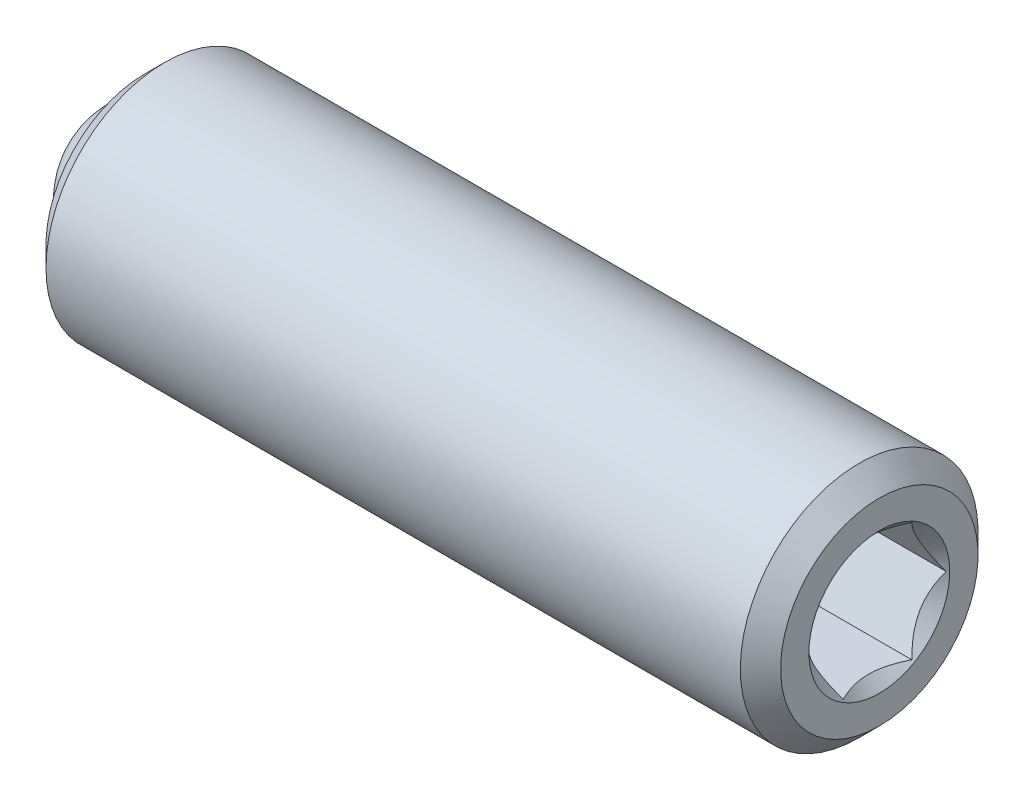
ISO-10303-21;
HEADER;
FILE_DESCRIPTION(('STEP AP214'),'2;1');
FILE_NAME('part.step','',(''),(''),'','','');
FILE_SCHEMA(('AUTOMOTIVE_DESIGN { 1 0 10303 214 1 1 1 1 }'));
ENDSEC;
DATA;
#1=APPLICATION_CONTEXT('core data for automotive mechanical design processes');
#2=APPLICATION_PROTOCOL_DEFINITION('international standard','automotive_design',2000,#1);
#3=PRODUCT_CONTEXT('',#1,'mechanical');
#4=PRODUCT('Part','Part','',(#3));
#5=PRODUCT_RELATED_PRODUCT_CATEGORY('part','',(#4));
#6=PRODUCT_DEFINITION_FORMATION('','',#4);
#7=PRODUCT_DEFINITION_CONTEXT('part definition',#1,'design');
#8=PRODUCT_DEFINITION('design','',#6,#7);
#9=PRODUCT_DEFINITION_SHAPE('','',#8);
#10=(LENGTH_UNIT() NAMED_UNIT(*) SI_UNIT(.MILLI.,.METRE.));
#11=(NAMED_UNIT(*) PLANE_ANGLE_UNIT() SI_UNIT($,.RADIAN.));
#12=(NAMED_UNIT(*) SI_UNIT($,.STERADIAN.) SOLID_ANGLE_UNIT());
#13=UNCERTAINTY_MEASURE_WITH_UNIT(LENGTH_MEASURE(1.E-05),#10,'distance_accuracy_value','');
#14=(GEOMETRIC_REPRESENTATION_CONTEXT(3) GLOBAL_UNCERTAINTY_ASSIGNED_CONTEXT((#13)) GLOBAL_UNIT_ASSIGNED_CONTEXT((#10,
#11,#12)) REPRESENTATION_CONTEXT('',''));
#15=CARTESIAN_POINT('',(0.,0.,0.));
#16=DIRECTION('',(0.,0.,1.));
#17=DIRECTION('',(1.,0.,0.));
#18=AXIS2_PLACEMENT_3D('',#15,#16,#17);
#19=CARTESIAN_POINT('',(-5.26775896178356,1.14341220093835,-0.203857779682182));
#20=DIRECTION('',(1.,0.,0.));
#21=DIRECTION('',(0.,1.,0.));
#22=AXIS2_PLACEMENT_3D('',#19,#20,#21);
#23=PLANE('',#22);
#24=CARTESIAN_POINT('',(-5.26775896178356,0.140112200938348,-0.203857779682182));
#25=DIRECTION('',(1.,0.,0.));
#26=DIRECTION('',(0.,1.,0.));
#27=AXIS2_PLACEMENT_3D('',#24,#25,#26);
#28=CIRCLE('',#27,1.246);
#29=CARTESIAN_POINT('',(-5.26775896178356,1.38611220093835,-0.203857779682182));
#30=VERTEX_POINT('',#29);
#31=EDGE_CURVE('P0_E30',#30,#30,#28,.F.);
#32=ORIENTED_EDGE('',*,*,#31,.T.);
#33=EDGE_LOOP('',(#32));
#34=FACE_BOUND('',#33,.T.);
#35=CARTESIAN_POINT('',(-5.26775896178356,0.140112200938348,-0.203857779682182));
#36=DIRECTION('',(-1.,0.,0.));
#37=DIRECTION('',(0.,-1.,0.));
#38=AXIS2_PLACEMENT_3D('',#35,#36,#37);
#39=CIRCLE('',#38,1.0033);
#40=CARTESIAN_POINT('',(-5.26775896178356,-0.863187799061652,-0.203857779682182));
#41=VERTEX_POINT('',#40);
#42=EDGE_CURVE('P0_E105',#41,#41,#39,.T.);
#43=ORIENTED_EDGE('',*,*,#42,.F.);
#44=EDGE_LOOP('',(#43));
#45=FACE_BOUND('',#44,.T.);
#46=ADVANCED_FACE('P0_F17',(#34,#45),#23,.F.);
#47=CARTESIAN_POINT('',(-3.59137664832728,0.140112200938348,-0.203857779682182));
#48=DIRECTION('',(-1.,0.,0.));
#49=DIRECTION('',(0.,-1.,0.));
#50=AXIS2_PLACEMENT_3D('',#47,#48,#49);
#51=CYLINDRICAL_SURFACE('',#50,1.0033);
#52=CARTESIAN_POINT('',(-4.59467664832728,0.140112200938348,-0.203857779682182));
#53=DIRECTION('',(-1.,0.,0.));
#54=DIRECTION('',(0.,-1.,0.));
#55=AXIS2_PLACEMENT_3D('',#52,#53,#54);
#56=CIRCLE('',#55,1.0033);
#57=CARTESIAN_POINT('',(-4.59467664832728,-0.863187799061652,-0.203857779682182));
#58=VERTEX_POINT('',#57);
#59=EDGE_CURVE('P0_E102',#58,#58,#56,.T.);
#60=ORIENTED_EDGE('',*,*,#59,.F.);
#61=EDGE_LOOP('',(#60));
#62=FACE_BOUND('',#61,.T.);
#63=ORIENTED_EDGE('',*,*,#42,.T.);
#64=EDGE_LOOP('',(#63));
#65=FACE_BOUND('',#64,.T.);
#66=ADVANCED_FACE('P0_F135',(#62,#65),#51,.F.);
#67=CARTESIAN_POINT('',(-4.59467664832728,0.140112200938348,-0.203857779682182));
#68=DIRECTION('',(-1.,0.,0.));
#69=DIRECTION('',(0.,-1.,0.));
#70=AXIS2_PLACEMENT_3D('',#67,#68,#69);
#71=CONICAL_SURFACE('',#70,1.0033,0.78539816339745);
#72=CARTESIAN_POINT('',(-3.59137664832728,0.140112200938348,-0.203857779682182));
#73=VERTEX_POINT('',#72);
#74=VERTEX_LOOP('',#73);
#75=FACE_BOUND('',#74,.T.);
#76=ORIENTED_EDGE('',*,*,#59,.T.);
#77=EDGE_LOOP('',(#76));
#78=FACE_BOUND('',#77,.T.);
#79=ADVANCED_FACE('P0_F140',(#75,#78),#71,.F.);
#80=CARTESIAN_POINT('',(4.00324103821644,0.140112200938348,-0.203857779682182));
#81=DIRECTION('',(-1.,0.,0.));
#82=DIRECTION('',(0.,-1.,0.));
#83=AXIS2_PLACEMENT_3D('',#80,#81,#82);
#84=PLANE('',#83);
#85=CARTESIAN_POINT('',(4.00324103821644,0.140112200938347,-0.203857779682182));
#86=DIRECTION('',(1.,0.,0.));
#87=DIRECTION('',(0.,1.,0.));
#88=AXIS2_PLACEMENT_3D('',#85,#86,#87);
#89=CIRCLE('',#88,0.889);
#90=CARTESIAN_POINT('',(4.00324103821644,1.02911220093835,-0.203857779682182));
#91=VERTEX_POINT('',#90);
#92=EDGE_CURVE('P0_E232',#91,#91,#89,.T.);
#93=ORIENTED_EDGE('',*,*,#92,.F.);
#94=EDGE_LOOP('',(#93));
#95=FACE_BOUND('',#94,.T.);
#96=CARTESIAN_POINT('',(4.00324103821644,0.140112200938348,-0.203857779682182));
#97=DIRECTION('',(-1.,0.,0.));
#98=DIRECTION('',(0.,-1.,0.));
#99=AXIS2_PLACEMENT_3D('',#96,#97,#98);
#100=CIRCLE('',#99,1.246);
#101=CARTESIAN_POINT('',(4.00324103821644,-1.10588779906165,-0.203857779682182));
#102=VERTEX_POINT('',#101);
#103=EDGE_CURVE('P0_E114',#102,#102,#100,.F.);
#104=ORIENTED_EDGE('',*,*,#103,.T.);
#105=EDGE_LOOP('',(#104));
#106=FACE_BOUND('',#105,.T.);
#107=ADVANCED_FACE('P0_F146',(#95,#106),#84,.F.);
#108=CARTESIAN_POINT('',(-3.59137664832728,0.140112200938348,-0.203857779682182));
#109=DIRECTION('',(-1.,0.,0.));
#110=DIRECTION('',(0.,-1.,0.));
#111=AXIS2_PLACEMENT_3D('',#108,#109,#110);
#112=CYLINDRICAL_SURFACE('',#111,1.5);
#113=CARTESIAN_POINT('',(3.74924103821644,0.140112200938348,-0.203857779682182));
#114=DIRECTION('',(-1.,0.,0.));
#115=DIRECTION('',(0.,-1.,0.));
#116=AXIS2_PLACEMENT_3D('',#113,#114,#115);
#117=CIRCLE('',#116,1.5);
#118=CARTESIAN_POINT('',(3.74924103821644,-1.35988779906165,-0.203857779682182));
#119=VERTEX_POINT('',#118);
#120=EDGE_CURVE('P0_E111',#119,#119,#117,.T.);
#121=ORIENTED_EDGE('',*,*,#120,.T.);
#122=EDGE_LOOP('',(#121));
#123=FACE_BOUND('',#122,.T.);
#124=CARTESIAN_POINT('',(-5.01375896178356,0.140112200938348,-0.203857779682182));
#125=DIRECTION('',(1.,0.,0.));
#126=DIRECTION('',(0.,1.,0.));
#127=AXIS2_PLACEMENT_3D('',#124,#125,#126);
#128=CIRCLE('',#127,1.5);
#129=CARTESIAN_POINT('',(-5.01375896178356,1.64011220093835,-0.203857779682182));
#130=VERTEX_POINT('',#129);
#131=EDGE_CURVE('P0_E108',#130,#130,#128,.T.);
#132=ORIENTED_EDGE('',*,*,#131,.T.);
#133=EDGE_LOOP('',(#132));
#134=FACE_BOUND('',#133,.T.);
#135=ADVANCED_FACE('P0_F131',(#123,#134),#112,.T.);
#136=CARTESIAN_POINT('',(3.74924103821644,0.140112200938348,-0.203857779682182));
#137=DIRECTION('',(-1.,0.,0.));
#138=DIRECTION('',(0.,-1.,0.));
#139=AXIS2_PLACEMENT_3D('',#136,#137,#138);
#140=CONICAL_SURFACE('',#139,1.5,0.78539816339745);
#141=ORIENTED_EDGE('',*,*,#103,.F.);
#142=EDGE_LOOP('',(#141));
#143=FACE_BOUND('',#142,.T.);
#144=ORIENTED_EDGE('',*,*,#120,.F.);
#145=EDGE_LOOP('',(#144));
#146=FACE_BOUND('',#145,.T.);
#147=ADVANCED_FACE('P0_F122',(#143,#146),#140,.T.);
#148=CARTESIAN_POINT('',(-5.26775896178356,0.140112200938348,-0.203857779682182));
#149=DIRECTION('',(1.,0.,0.));
#150=DIRECTION('',(0.,1.,0.));
#151=AXIS2_PLACEMENT_3D('',#148,#149,#150);
#152=CONICAL_SURFACE('',#151,1.246,0.785398163397445);
#153=ORIENTED_EDGE('',*,*,#131,.F.);
#154=EDGE_LOOP('',(#153));
#155=FACE_BOUND('',#154,.T.);
#156=ORIENTED_EDGE('',*,*,#31,.F.);
#157=EDGE_LOOP('',(#156));
#158=FACE_BOUND('',#157,.T.);
#159=ADVANCED_FACE('P0_F19',(#155,#158),#152,.T.);
#160=CARTESIAN_POINT('',(4.00324103821644,0.140112200938347,-0.203857779682182));
#161=DIRECTION('',(1.,0.,0.));
#162=DIRECTION('',(0.,1.,0.));
#163=AXIS2_PLACEMENT_3D('',#160,#161,#162);
#164=CONICAL_SURFACE('',#163,0.889,0.78539816339745);
#165=ORIENTED_EDGE('',*,*,#92,.T.);
#166=EDGE_LOOP('',(#165));
#167=FACE_BOUND('',#166,.T.);
#168=CARTESIAN_POINT('',(4.27011407340164,0.890112200938348,-1.08337041374052));
#169=CARTESIAN_POINT('',(4.25387468321521,0.890112200938348,-1.06202509157628));
#170=CARTESIAN_POINT('',(4.23778979157522,0.890112200938348,-1.04056255208413));
#171=CARTESIAN_POINT('',(4.20599327113775,0.890112200938348,-0.997354976569362));
#172=CARTESIAN_POINT('',(4.19028173410769,0.890112200938348,-0.975609873085505));
#173=CARTESIAN_POINT('',(4.1435791702077,0.890112200938348,-0.909560196027857));
#174=CARTESIAN_POINT('',(4.11327002806285,0.890112200938348,-0.864765498836226));
#175=CARTESIAN_POINT('',(4.05362204548442,0.890112200938348,-0.770727906260526));
#176=CARTESIAN_POINT('',(4.02444847758762,0.890112200938348,-0.721378973428742));
#177=CARTESIAN_POINT('',(3.97098003069421,0.890112200938348,-0.620199376924882));
#178=CARTESIAN_POINT('',(3.94666868692797,0.890112200938348,-0.568377850854046));
#179=CARTESIAN_POINT('',(3.91692427189314,0.890112200938348,-0.490735867713308));
#180=CARTESIAN_POINT('',(3.90841515008199,0.890112200938348,-0.466103184642786));
#181=CARTESIAN_POINT('',(3.89336731195443,0.890112200938348,-0.416242867264108));
#182=CARTESIAN_POINT('',(3.88682872705705,0.890112200938348,-0.391015193395758));
#183=CARTESIAN_POINT('',(3.87094826365662,0.890112200938348,-0.315512298621015));
#184=CARTESIAN_POINT('',(3.86494656519245,0.890112200938348,-0.264454169848514));
#185=CARTESIAN_POINT('',(3.86368028255774,0.890112200938348,-0.164196712133303));
#186=CARTESIAN_POINT('',(3.86800545625288,0.890112200938348,-0.115002678500581));
#187=CARTESIAN_POINT('',(3.88110376344025,0.890112200938348,-0.0420620616330124));
#188=CARTESIAN_POINT('',(3.88665433171372,0.890112200938348,-0.0176697553897661));
#189=CARTESIAN_POINT('',(3.89969014752514,0.890112200938348,0.0305909359954269));
#190=CARTESIAN_POINT('',(3.90717525349171,0.890112200938348,0.0544593593370276));
#191=CARTESIAN_POINT('',(3.93335528323793,0.890112200938348,0.128893354159198));
#192=CARTESIAN_POINT('',(3.95500389672139,0.890112200938348,0.178414114462773));
#193=CARTESIAN_POINT('',(4.00315487646798,0.890112200938348,0.275137718993897));
#194=CARTESIAN_POINT('',(4.02967453883853,0.890112200938348,0.322331518174599));
#195=CARTESIAN_POINT('',(4.08440802883982,0.890112200938348,0.412534674067127));
#196=CARTESIAN_POINT('',(4.11247299614644,0.890112200938348,0.455635521889964));
#197=CARTESIAN_POINT('',(4.15586742055102,0.890112200938348,0.519135833531515));
#198=CARTESIAN_POINT('',(4.1704869668323,0.890112200938348,0.540028947080532));
#199=CARTESIAN_POINT('',(4.20011508568024,0.890112200938348,0.581529175017311));
#200=CARTESIAN_POINT('',(4.21512355062861,0.890112200938348,0.602136366150134));
#201=CARTESIAN_POINT('',(4.2302933572417,0.890112200938348,0.622624391209399));
#202=B_SPLINE_CURVE_WITH_KNOTS('',3,(#168,#169,#170,#171,#172,#173,#174,#175,#176,#177,#178,
#179,#180,#181,#182,#183,#184,#185,#186,#187,#188,#189,#190,#191,#192,#193,#194,#195,#196,#197,
#198,#199,#200,#201),.UNSPECIFIED.,.F.,.F.,(4,2,2,2,2,2,2,2,2,2,2,2,2,2,2,2,4),(0.,
0.0804596117681744,0.160938799452028,0.323124453194973,0.494968571191811,0.666220542229086,
0.744331171665941,0.822447009304213,0.975597152051797,1.12276514368748,1.1977430644728,
1.27271549985279,1.4343836465341,1.59663734906444,1.75085876684992,1.82735598888854,
1.90383226465774),.UNSPECIFIED.);
#203=CARTESIAN_POINT('',(3.98026644200088,0.890112200938348,-0.636870481574401));
#204=VERTEX_POINT('',#203);
#205=CARTESIAN_POINT('',(3.98026644200088,0.890112200938348,0.229154922210038));
#206=VERTEX_POINT('',#205);
#207=EDGE_CURVE('P0_E86',#204,#206,#202,.T.);
#208=ORIENTED_EDGE('',*,*,#207,.F.);
#209=CARTESIAN_POINT('',(3.98038193514565,0.139912200938348,-1.06999865352046));
#210=CARTESIAN_POINT('',(3.9655005524648,0.165702163496029,-1.05510881169539));
#211=CARTESIAN_POINT('',(3.95149270760784,0.191923403067007,-1.0399699719706));
#212=CARTESIAN_POINT('',(3.92584396668314,0.245391909174054,-1.00909991557653));
#213=CARTESIAN_POINT('',(3.91421735370655,0.272644268398921,-0.993365758642001));
#214=CARTESIAN_POINT('',(3.89430048777312,0.327597551319701,-0.961638465954835));
#215=CARTESIAN_POINT('',(3.88596013608225,0.355284457633857,-0.945653423141328));
#216=CARTESIAN_POINT('',(3.8731091839623,0.411267796069201,-0.913331427625549));
#217=CARTESIAN_POINT('',(3.86858898258971,0.439562515781993,-0.896995463582724));
#218=CARTESIAN_POINT('',(3.86451227509831,0.488322490207191,-0.868843879222656));
#219=CARTESIAN_POINT('',(3.86390923861496,0.50872426659392,-0.857064908133832));
#220=CARTESIAN_POINT('',(3.86492094801641,0.549488335634708,-0.833529761899868));
#221=CARTESIAN_POINT('',(3.86653618299091,0.569850618589803,-0.821773592354429));
#222=CARTESIAN_POINT('',(3.87460258897392,0.630646744025172,-0.786672932968633));
#223=CARTESIAN_POINT('',(3.8842753778286,0.670778055934447,-0.76350310923488));
#224=CARTESIAN_POINT('',(3.90762275997319,0.741222601292374,-0.72283193200954));
#225=CARTESIAN_POINT('',(3.92007500007313,0.771865772947434,-0.705140088605667));
#226=CARTESIAN_POINT('',(3.94812605223174,0.831951546743137,-0.670449550930251));
#227=CARTESIAN_POINT('',(3.96371462790463,0.861397689319938,-0.653448812586938));
#228=CARTESIAN_POINT('',(3.98038193514565,0.890312200938348,-0.636755011520563));
#229=B_SPLINE_CURVE_WITH_KNOTS('',3,(#209,#210,#211,#212,#213,#214,#215,#216,#217,#218,#219,
#220,#221,#222,#223,#224,#225,#226,#227,#228),.UNSPECIFIED.,.F.,.F.,(4,2,2,2,2,2,2,2,2,4),(0.,
0.0999419466095597,0.200466857654446,0.299393763705717,0.39807129730023,0.468665775681748,
0.539275821398839,0.680536257244566,0.792918418368074,0.904939568716032),.UNSPECIFIED.);
#230=CARTESIAN_POINT('',(3.98026644200088,0.140112200938348,-1.06988318346662));
#231=VERTEX_POINT('',#230);
#232=EDGE_CURVE('P0_E187',#231,#204,#229,.T.);
#233=ORIENTED_EDGE('',*,*,#232,.F.);
#234=CARTESIAN_POINT('',(3.98038193514565,-0.610087799061652,-0.636755011520563));
#235=CARTESIAN_POINT('',(3.9655005524648,-0.584297836503971,-0.651644853345631));
#236=CARTESIAN_POINT('',(3.95149270760783,-0.558076596932993,-0.66678369307042));
#237=CARTESIAN_POINT('',(3.92584396668314,-0.504608090825946,-0.697653749464491));
#238=CARTESIAN_POINT('',(3.91421735370654,-0.47735573160108,-0.71338790639902));
#239=CARTESIAN_POINT('',(3.89430048777312,-0.422402448680299,-0.745115199086186));
#240=CARTESIAN_POINT('',(3.88596013608225,-0.394715542366143,-0.761100241899692));
#241=CARTESIAN_POINT('',(3.8731091839623,-0.3387322039308,-0.793422237415472));
#242=CARTESIAN_POINT('',(3.86858898258971,-0.310437484218008,-0.809758201458297));
#243=CARTESIAN_POINT('',(3.86451227509831,-0.261677509792809,-0.837909785818365));
#244=CARTESIAN_POINT('',(3.86390923861496,-0.24127573340608,-0.849688756907189));
#245=CARTESIAN_POINT('',(3.86492094801641,-0.200511664365293,-0.873223903141153));
#246=CARTESIAN_POINT('',(3.86653618299091,-0.180149381410198,-0.884980072686592));
#247=CARTESIAN_POINT('',(3.87460258897392,-0.119353255974829,-0.920080732072388));
#248=CARTESIAN_POINT('',(3.8842753778286,-0.0792219440655536,-0.943250555806141));
#249=CARTESIAN_POINT('',(3.90762275997319,-0.00877739870762711,-0.983921733031481));
#250=CARTESIAN_POINT('',(3.92007500007313,0.0218657729474335,-1.00161357643535));
#251=CARTESIAN_POINT('',(3.94812605223174,0.081951546743137,-1.03630411411077));
#252=CARTESIAN_POINT('',(3.96371462790463,0.111397689319938,-1.05330485245408));
#253=CARTESIAN_POINT('',(3.98038193514565,0.140312200938348,-1.06999865352046));
#254=B_SPLINE_CURVE_WITH_KNOTS('',3,(#234,#235,#236,#237,#238,#239,#240,#241,#242,#243,#244,
#245,#246,#247,#248,#249,#250,#251,#252,#253),.UNSPECIFIED.,.F.,.F.,(4,2,2,2,2,2,2,2,2,4),(0.,
0.0999419466095592,0.200466857654446,0.299393763705717,0.398071297300229,0.468665775681747,
0.539275821398838,0.680536257244565,0.792918418368073,0.904939568716031),.UNSPECIFIED.);
#255=CARTESIAN_POINT('',(3.98026644200088,-0.609887799061652,-0.636870481574401));
#256=VERTEX_POINT('',#255);
#257=EDGE_CURVE('P0_E182',#256,#231,#254,.T.);
#258=ORIENTED_EDGE('',*,*,#257,.F.);
#259=CARTESIAN_POINT('',(4.27011407342134,-0.609887799061652,-1.08337041376642));
#260=CARTESIAN_POINT('',(4.25387468323415,-0.609887799061652,-1.06202509160145));
#261=CARTESIAN_POINT('',(4.23778979159341,-0.609887799061652,-1.04056255210855));
#262=CARTESIAN_POINT('',(4.20599327115442,-0.609887799061652,-0.997354976592305));
#263=CARTESIAN_POINT('',(4.19028173412361,-0.609887799061652,-0.975609873107703));
#264=CARTESIAN_POINT('',(4.14357917022134,-0.609887799061652,-0.909560196047775));
#265=CARTESIAN_POINT('',(4.11327002807497,-0.609887799061652,-0.864765498854596));
#266=CARTESIAN_POINT('',(4.05362204549342,-0.609887799061652,-0.770727906275515));
#267=CARTESIAN_POINT('',(4.02444847759503,-0.609887799061652,-0.721378973441891));
#268=CARTESIAN_POINT('',(3.97098003069867,-0.609887799061652,-0.620199376934196));
#269=CARTESIAN_POINT('',(3.94666868693107,-0.609887799061652,-0.568377850861365));
#270=CARTESIAN_POINT('',(3.91692427189523,-0.609887799061652,-0.490735867719131));
#271=CARTESIAN_POINT('',(3.90841515008414,-0.609887799061652,-0.466103184649244));
#272=CARTESIAN_POINT('',(3.89336731195656,-0.609887799061652,-0.416242867271859));
#273=CARTESIAN_POINT('',(3.88682872705911,-0.609887799061652,-0.391015193404165));
#274=CARTESIAN_POINT('',(3.87094826365822,-0.609887799061652,-0.315512298631347));
#275=CARTESIAN_POINT('',(3.86494656519346,-0.609887799061652,-0.264454169860129));
#276=CARTESIAN_POINT('',(3.86368028255708,-0.609887799061652,-0.164196712147121));
#277=CARTESIAN_POINT('',(3.86800545625118,-0.609887799061652,-0.115002678515325));
#278=CARTESIAN_POINT('',(3.88110376343688,-0.609887799061652,-0.0420620616490278));
#279=CARTESIAN_POINT('',(3.88665433170976,-0.609887799061652,-0.0176697554062038));
#280=CARTESIAN_POINT('',(3.89969014752,-0.609887799061652,0.0305909359781862));
#281=CARTESIAN_POINT('',(3.90717525348597,-0.609887799061652,0.0544593593194063));
#282=CARTESIAN_POINT('',(3.9333552832294,-0.609887799061652,0.128893354137777));
#283=CARTESIAN_POINT('',(3.95500389671029,-0.609887799061652,0.178414114438125));
#284=CARTESIAN_POINT('',(4.00315487645145,-0.609887799061652,0.275137718963042));
#285=CARTESIAN_POINT('',(4.02967453881914,-0.609887799061652,0.322331518140767));
#286=CARTESIAN_POINT('',(4.08440802881497,-0.609887799061652,0.412534674027943));
#287=CARTESIAN_POINT('',(4.112472996119,-0.609887799061652,0.455635521848388));
#288=CARTESIAN_POINT('',(4.15586742051971,-0.609887799061652,0.519135833486402));
#289=CARTESIAN_POINT('',(4.17048696679972,-0.609887799061652,0.540028947034257));
#290=CARTESIAN_POINT('',(4.20011508564509,-0.609887799061652,0.58152917496872));
#291=CARTESIAN_POINT('',(4.21512355059219,-0.609887799061652,0.60213636610039));
#292=CARTESIAN_POINT('',(4.23029335720401,-0.609887799061652,0.622624391158503));
#293=B_SPLINE_CURVE_WITH_KNOTS('',3,(#259,#260,#261,#262,#263,#264,#265,#266,#267,#268,#269,
#270,#271,#272,#273,#274,#275,#276,#277,#278,#279,#280,#281,#282,#283,#284,#285,#286,#287,#288,
#289,#290,#291,#292),.UNSPECIFIED.,.F.,.F.,(4,2,2,2,2,2,2,2,2,2,2,2,2,2,2,2,4),(0.,
0.0804596117713113,0.160938799458303,0.323124453207642,0.49496857121166,0.666220542256047,
0.744331171691054,0.822447009327482,0.975597152071553,1.12276514370424,1.19774306448793,
1.27271549986629,1.43438364653569,1.59663734905404,1.75085876682927,1.82735598886284,
1.90383226462699),.UNSPECIFIED.);
#294=CARTESIAN_POINT('',(3.98026644200088,-0.609887799061652,0.229154922210038));
#295=VERTEX_POINT('',#294);
#296=EDGE_CURVE('P0_E37',#295,#256,#293,.F.);
#297=ORIENTED_EDGE('',*,*,#296,.F.);
#298=CARTESIAN_POINT('',(3.98038193514565,0.140312200938348,0.662283094156095));
#299=CARTESIAN_POINT('',(3.9655005524648,0.114522238380666,0.647393252331027));
#300=CARTESIAN_POINT('',(3.95149270760783,0.0883009988096884,0.632254412606237));
#301=CARTESIAN_POINT('',(3.92584396668314,0.0348324927026411,0.601384356212166));
#302=CARTESIAN_POINT('',(3.91421735370654,0.00758013347777464,0.585650199277637));
#303=CARTESIAN_POINT('',(3.89430048777312,-0.0473731494430057,0.553922906590471));
#304=CARTESIAN_POINT('',(3.88596013608225,-0.0750600557571621,0.537937863776965));
#305=CARTESIAN_POINT('',(3.8731091839623,-0.131043394192506,0.505615868261185));
#306=CARTESIAN_POINT('',(3.86858898258971,-0.159338113905298,0.48927990421836));
#307=CARTESIAN_POINT('',(3.86451227509831,-0.208098088330496,0.461128319858292));
#308=CARTESIAN_POINT('',(3.86390923861496,-0.228499864717225,0.449349348769468));
#309=CARTESIAN_POINT('',(3.86492094801641,-0.269263933758013,0.425814202535505));
#310=CARTESIAN_POINT('',(3.86653618299091,-0.289626216713108,0.414058032990065));
#311=CARTESIAN_POINT('',(3.87460258897392,-0.350422342148477,0.378957373604269));
#312=CARTESIAN_POINT('',(3.8842753778286,-0.390553654057752,0.355787549870516));
#313=CARTESIAN_POINT('',(3.90762275997319,-0.460998199415678,0.315116372645176));
#314=CARTESIAN_POINT('',(3.92007500007313,-0.491641371070739,0.297424529241303));
#315=CARTESIAN_POINT('',(3.94812605223174,-0.551727144866442,0.262733991565887));
#316=CARTESIAN_POINT('',(3.96371462790463,-0.581173287443243,0.245733253222575));
#317=CARTESIAN_POINT('',(3.98038193514565,-0.610087799061652,0.2290394521562));
#318=B_SPLINE_CURVE_WITH_KNOTS('',3,(#298,#299,#300,#301,#302,#303,#304,#305,#306,#307,#308,
#309,#310,#311,#312,#313,#314,#315,#316,#317),.UNSPECIFIED.,.F.,.F.,(4,2,2,2,2,2,2,2,2,4),(0.,
0.0999419466095599,0.200466857654446,0.299393763705718,0.398071297300231,0.468665775681748,
0.53927582139884,0.680536257244567,0.792918418368074,0.904939568716031),.UNSPECIFIED.);
#319=CARTESIAN_POINT('',(3.98026644200088,0.140112200938348,0.662167624102257));
#320=VERTEX_POINT('',#319);
#321=EDGE_CURVE('P0_E11',#320,#295,#318,.T.);
#322=ORIENTED_EDGE('',*,*,#321,.F.);
#323=CARTESIAN_POINT('',(3.98038193514565,0.890312200938348,0.2290394521562));
#324=CARTESIAN_POINT('',(3.9655005524648,0.864522238380666,0.243929293981268));
#325=CARTESIAN_POINT('',(3.95149270760784,0.838300998809689,0.259068133706057));
#326=CARTESIAN_POINT('',(3.92584396668314,0.784832492702641,0.289938190100128));
#327=CARTESIAN_POINT('',(3.91421735370655,0.757580133477775,0.305672347034657));
#328=CARTESIAN_POINT('',(3.89430048777312,0.702626850556994,0.337399639721823));
#329=CARTESIAN_POINT('',(3.88596013608225,0.674939944242838,0.35338468253533));
#330=CARTESIAN_POINT('',(3.8731091839623,0.618956605807494,0.385706678051109));
#331=CARTESIAN_POINT('',(3.86858898258971,0.590661886094702,0.402042642093935));
#332=CARTESIAN_POINT('',(3.86451227509831,0.541901911669504,0.430194226454002));
#333=CARTESIAN_POINT('',(3.86390923861496,0.521500135282774,0.441973197542827));
#334=CARTESIAN_POINT('',(3.86492094801641,0.480736066241987,0.46550834377679));
#335=CARTESIAN_POINT('',(3.86653618299091,0.460373783286892,0.47726451332223));
#336=CARTESIAN_POINT('',(3.87460258897392,0.399577657851523,0.512365172708026));
#337=CARTESIAN_POINT('',(3.8842753778286,0.359446345942248,0.535534996441779));
#338=CARTESIAN_POINT('',(3.90762275997319,0.289001800584321,0.576206173667118));
#339=CARTESIAN_POINT('',(3.92007500007313,0.258358628929261,0.593898017070992));
#340=CARTESIAN_POINT('',(3.94812605223174,0.198272855133558,0.628588554746408));
#341=CARTESIAN_POINT('',(3.96371462790463,0.168826712556757,0.64558929308972));
#342=CARTESIAN_POINT('',(3.98038193514565,0.139912200938348,0.662283094156095));
#343=B_SPLINE_CURVE_WITH_KNOTS('',3,(#323,#324,#325,#326,#327,#328,#329,#330,#331,#332,#333,
#334,#335,#336,#337,#338,#339,#340,#341,#342),.UNSPECIFIED.,.F.,.F.,(4,2,2,2,2,2,2,2,2,4),(0.,
0.0999419466095594,0.200466857654447,0.299393763705718,0.398071297300231,0.468665775681749,
0.53927582139884,0.680536257244567,0.792918418368074,0.904939568716031),.UNSPECIFIED.);
#344=EDGE_CURVE('P0_E73',#206,#320,#343,.T.);
#345=ORIENTED_EDGE('',*,*,#344,.F.);
#346=EDGE_LOOP('',(#208,#233,#258,#297,#322,#345));
#347=FACE_BOUND('',#346,.T.);
#348=ADVANCED_FACE('P0_F72',(#167,#347),#164,.F.);
#349=CARTESIAN_POINT('',(0.955241038216439,0.140112200938347,-0.203857779682182));
#350=DIRECTION('',(1.,0.,0.));
#351=DIRECTION('',(0.,0.,-1.));
#352=AXIS2_PLACEMENT_3D('',#349,#350,#351);
#353=PLANE('',#352);
#354=DIRECTION('',(0.,-0.866025403784439,0.5));
#355=VECTOR('',#354,1.);
#356=CARTESIAN_POINT('',(0.955241038216439,0.890112200938348,0.229154922210038));
#357=LINE('',#356,#355);
#358=CARTESIAN_POINT('',(0.955241038216439,0.890112200938348,0.229154922210038));
#359=VERTEX_POINT('',#358);
#360=CARTESIAN_POINT('',(0.955241038216439,0.140112200938348,0.662167624102257));
#361=VERTEX_POINT('',#360);
#362=EDGE_CURVE('P0_E85',#359,#361,#357,.T.);
#363=ORIENTED_EDGE('',*,*,#362,.T.);
#364=DIRECTION('',(0.,-0.866025403784439,-0.5));
#365=VECTOR('',#364,1.);
#366=CARTESIAN_POINT('',(0.955241038216439,0.140112200938348,0.662167624102257));
#367=LINE('',#366,#365);
#368=CARTESIAN_POINT('',(0.955241038216439,-0.609887799061652,0.229154922210038));
#369=VERTEX_POINT('',#368);
#370=EDGE_CURVE('P0_E90',#361,#369,#367,.T.);
#371=ORIENTED_EDGE('',*,*,#370,.T.);
#372=DIRECTION('',(0.,0.,-1.));
#373=VECTOR('',#372,1.);
#374=CARTESIAN_POINT('',(0.955241038216439,-0.609887799061652,0.229154922210038));
#375=LINE('',#374,#373);
#376=CARTESIAN_POINT('',(0.955241038216439,-0.609887799061652,-0.636870481574401));
#377=VERTEX_POINT('',#376);
#378=EDGE_CURVE('P0_E212',#369,#377,#375,.T.);
#379=ORIENTED_EDGE('',*,*,#378,.T.);
#380=DIRECTION('',(0.,0.866025403784439,-0.5));
#381=VECTOR('',#380,1.);
#382=CARTESIAN_POINT('',(0.955241038216439,-0.609887799061652,-0.636870481574401));
#383=LINE('',#382,#381);
#384=CARTESIAN_POINT('',(0.955241038216439,0.140112200938348,-1.06988318346662));
#385=VERTEX_POINT('',#384);
#386=EDGE_CURVE('P0_E216',#377,#385,#383,.T.);
#387=ORIENTED_EDGE('',*,*,#386,.T.);
#388=DIRECTION('',(0.,0.866025403784439,0.5));
#389=VECTOR('',#388,1.);
#390=CARTESIAN_POINT('',(0.955241038216439,0.140112200938348,-1.06988318346662));
#391=LINE('',#390,#389);
#392=CARTESIAN_POINT('',(0.955241038216439,0.890112200938348,-0.636870481574401));
#393=VERTEX_POINT('',#392);
#394=EDGE_CURVE('P0_E98',#385,#393,#391,.T.);
#395=ORIENTED_EDGE('',*,*,#394,.T.);
#396=DIRECTION('',(0.,0.,1.));
#397=VECTOR('',#396,1.);
#398=CARTESIAN_POINT('',(0.955241038216439,0.890112200938348,-0.636870481574401));
#399=LINE('',#398,#397);
#400=EDGE_CURVE('P0_E93',#393,#359,#399,.T.);
#401=ORIENTED_EDGE('',*,*,#400,.T.);
#402=EDGE_LOOP('',(#363,#371,#379,#387,#395,#401));
#403=FACE_BOUND('',#402,.T.);
#404=ADVANCED_FACE('P0_F129',(#403),#353,.T.);
#405=CARTESIAN_POINT('',(0.955241038216439,0.140112200938348,0.662167624102257));
#406=DIRECTION('',(0.,-0.5,0.866025403784439));
#407=DIRECTION('',(0.,-0.866025403784439,-0.5));
#408=AXIS2_PLACEMENT_3D('',#405,#406,#407);
#409=PLANE('',#408);
#410=DIRECTION('',(1.,0.,0.));
#411=VECTOR('',#410,1.);
#412=CARTESIAN_POINT('',(0.955241038216439,0.140112200938348,0.662167624102257));
#413=LINE('',#412,#411);
#414=EDGE_CURVE('P0_E82',#361,#320,#413,.T.);
#415=ORIENTED_EDGE('',*,*,#414,.T.);
#416=ORIENTED_EDGE('',*,*,#321,.T.);
#417=DIRECTION('',(1.,0.,0.));
#418=VECTOR('',#417,1.);
#419=CARTESIAN_POINT('',(0.955241038216439,-0.609887799061652,0.229154922210038));
#420=LINE('',#419,#418);
#421=EDGE_CURVE('P0_E92',#369,#295,#420,.T.);
#422=ORIENTED_EDGE('',*,*,#421,.F.);
#423=ORIENTED_EDGE('',*,*,#370,.F.);
#424=EDGE_LOOP('',(#415,#416,#422,#423));
#425=FACE_BOUND('',#424,.T.);
#426=ADVANCED_FACE('P0_F88',(#425),#409,.F.);
#427=CARTESIAN_POINT('',(0.955241038216439,-0.609887799061652,0.229154922210038));
#428=DIRECTION('',(0.,-1.,0.));
#429=DIRECTION('',(0.,0.,-1.));
#430=AXIS2_PLACEMENT_3D('',#427,#428,#429);
#431=PLANE('',#430);
#432=ORIENTED_EDGE('',*,*,#421,.T.);
#433=ORIENTED_EDGE('',*,*,#296,.T.);
#434=DIRECTION('',(1.,0.,0.));
#435=VECTOR('',#434,1.);
#436=CARTESIAN_POINT('',(0.955241038216439,-0.609887799061652,-0.636870481574401));
#437=LINE('',#436,#435);
#438=EDGE_CURVE('P0_E95',#377,#256,#437,.T.);
#439=ORIENTED_EDGE('',*,*,#438,.F.);
#440=ORIENTED_EDGE('',*,*,#378,.F.);
#441=EDGE_LOOP('',(#432,#433,#439,#440));
#442=FACE_BOUND('',#441,.T.);
#443=ADVANCED_FACE('P0_F201',(#442),#431,.F.);
#444=CARTESIAN_POINT('',(0.955241038216439,-0.609887799061652,-0.636870481574401));
#445=DIRECTION('',(0.,-0.5,-0.866025403784439));
#446=DIRECTION('',(0.,0.866025403784439,-0.5));
#447=AXIS2_PLACEMENT_3D('',#444,#445,#446);
#448=PLANE('',#447);
#449=ORIENTED_EDGE('',*,*,#438,.T.);
#450=ORIENTED_EDGE('',*,*,#257,.T.);
#451=DIRECTION('',(1.,0.,0.));
#452=VECTOR('',#451,1.);
#453=CARTESIAN_POINT('',(0.955241038216439,0.140112200938348,-1.06988318346662));
#454=LINE('',#453,#452);
#455=EDGE_CURVE('P0_E226',#385,#231,#454,.T.);
#456=ORIENTED_EDGE('',*,*,#455,.F.);
#457=ORIENTED_EDGE('',*,*,#386,.F.);
#458=EDGE_LOOP('',(#449,#450,#456,#457));
#459=FACE_BOUND('',#458,.T.);
#460=ADVANCED_FACE('P0_F196',(#459),#448,.F.);
#461=CARTESIAN_POINT('',(0.955241038216439,0.140112200938348,-1.06988318346662));
#462=DIRECTION('',(0.,0.5,-0.866025403784439));
#463=DIRECTION('',(0.,0.866025403784439,0.5));
#464=AXIS2_PLACEMENT_3D('',#461,#462,#463);
#465=PLANE('',#464);
#466=ORIENTED_EDGE('',*,*,#455,.T.);
#467=ORIENTED_EDGE('',*,*,#232,.T.);
#468=DIRECTION('',(1.,0.,0.));
#469=VECTOR('',#468,1.);
#470=CARTESIAN_POINT('',(0.955241038216439,0.890112200938348,-0.636870481574401));
#471=LINE('',#470,#469);
#472=EDGE_CURVE('P0_E223',#393,#204,#471,.T.);
#473=ORIENTED_EDGE('',*,*,#472,.F.);
#474=ORIENTED_EDGE('',*,*,#394,.F.);
#475=EDGE_LOOP('',(#466,#467,#473,#474));
#476=FACE_BOUND('',#475,.T.);
#477=ADVANCED_FACE('P0_F193',(#476),#465,.F.);
#478=CARTESIAN_POINT('',(0.955241038216439,0.890112200938348,-0.636870481574401));
#479=DIRECTION('',(0.,1.,0.));
#480=DIRECTION('',(0.,0.,1.));
#481=AXIS2_PLACEMENT_3D('',#478,#479,#480);
#482=PLANE('',#481);
#483=ORIENTED_EDGE('',*,*,#472,.T.);
#484=ORIENTED_EDGE('',*,*,#207,.T.);
#485=DIRECTION('',(1.,0.,0.));
#486=VECTOR('',#485,1.);
#487=CARTESIAN_POINT('',(0.955241038216439,0.890112200938348,0.229154922210038));
#488=LINE('',#487,#486);
#489=EDGE_CURVE('P0_E84',#359,#206,#488,.T.);
#490=ORIENTED_EDGE('',*,*,#489,.F.);
#491=ORIENTED_EDGE('',*,*,#400,.F.);
#492=EDGE_LOOP('',(#483,#484,#490,#491));
#493=FACE_BOUND('',#492,.T.);
#494=ADVANCED_FACE('P0_F155',(#493),#482,.F.);
#495=CARTESIAN_POINT('',(0.955241038216439,0.890112200938348,0.229154922210038));
#496=DIRECTION('',(0.,0.5,0.866025403784439));
#497=DIRECTION('',(0.,-0.866025403784439,0.5));
#498=AXIS2_PLACEMENT_3D('',#495,#496,#497);
#499=PLANE('',#498);
#500=ORIENTED_EDGE('',*,*,#489,.T.);
#501=ORIENTED_EDGE('',*,*,#344,.T.);
#502=ORIENTED_EDGE('',*,*,#414,.F.);
#503=ORIENTED_EDGE('',*,*,#362,.F.);
#504=EDGE_LOOP('',(#500,#501,#502,#503));
#505=FACE_BOUND('',#504,.T.);
#506=ADVANCED_FACE('P0_F80',(#505),#499,.F.);
#507=CLOSED_SHELL('',(#46,#66,#79,#107,#135,#147,#159,#348,#404,#426,#443,#460,#477,#494,#506));
#508=MANIFOLD_SOLID_BREP('P0_B1',#507);
#509=CARTESIAN_POINT('',(-5.00558738227335,0.14011220093836,-0.203857779682191));
#510=DIRECTION('',(0.,-0.0236507788482355,0.999720281208635));
#511=DIRECTION('',(0.,0.999720281208635,0.0236507788482355));
#512=AXIS2_PLACEMENT_3D('',#509,#510,#511);
#513=SPHERICAL_SURFACE('',#512,0.999998);
#514=CARTESIAN_POINT('',(-5.00558738227335,0.14011220093836,-0.203857779682191));
#515=DIRECTION('',(1.,0.,0.));
#516=DIRECTION('',(0.,0.999720281208635,0.0236507788482355));
#517=AXIS2_PLACEMENT_3D('',#514,#515,#516);
#518=CIRCLE('',#517,0.999998);
#519=CARTESIAN_POINT('',(-5.00558738227335,1.13983048270643,-0.180207048135513));
#520=VERTEX_POINT('',#519);
#521=CARTESIAN_POINT('',(-5.00558738227335,-0.859606080829713,-0.227508511228868));
#522=VERTEX_POINT('',#521);
#523=EDGE_CURVE('P1_E33',#520,#522,#518,.T.);
#524=ORIENTED_EDGE('',*,*,#523,.T.);
#525=CARTESIAN_POINT('',(-5.00558738227335,0.14011220093836,-0.203857779682191));
#526=DIRECTION('',(0.,-0.0236507788482355,0.999720281208635));
#527=DIRECTION('',(1.,0.,0.));
#528=AXIS2_PLACEMENT_3D('',#525,#526,#527);
#529=CIRCLE('',#528,0.999998);
#530=EDGE_CURVE('P1_E10',#522,#520,#529,.T.);
#531=ORIENTED_EDGE('',*,*,#530,.T.);
#532=EDGE_LOOP('',(#524,#531));
#533=FACE_BOUND('',#532,.T.);
#534=ADVANCED_FACE('P1_F16',(#533),#513,.T.);
#535=ORIENTED_EDGE('',*,*,#523,.F.);
#536=CARTESIAN_POINT('',(-5.00558738227335,0.14011220093836,-0.203857779682191));
#537=DIRECTION('',(0.,-0.0236507788482355,0.999720281208635));
#538=DIRECTION('',(1.,0.,0.));
#539=AXIS2_PLACEMENT_3D('',#536,#537,#538);
#540=CIRCLE('',#539,0.999998);
#541=EDGE_CURVE('P1_E23',#520,#522,#540,.T.);
#542=ORIENTED_EDGE('',*,*,#541,.T.);
#543=EDGE_LOOP('',(#535,#542));
#544=FACE_BOUND('',#543,.T.);
#545=ADVANCED_FACE('P1_F40',(#544),#513,.T.);
#546=ORIENTED_EDGE('',*,*,#530,.F.);
#547=EDGE_CURVE('P1_E36',#522,#520,#518,.T.);
#548=ORIENTED_EDGE('',*,*,#547,.T.);
#549=EDGE_LOOP('',(#546,#548));
#550=FACE_BOUND('',#549,.T.);
#551=ADVANCED_FACE('P1_F38',(#550),#513,.T.);
#552=ORIENTED_EDGE('',*,*,#541,.F.);
#553=ORIENTED_EDGE('',*,*,#547,.F.);
#554=EDGE_LOOP('',(#552,#553));
#555=FACE_BOUND('',#554,.T.);
#556=ADVANCED_FACE('P1_F18',(#555),#513,.T.);
#557=CLOSED_SHELL('',(#534,#545,#551,#556));
#558=MANIFOLD_SOLID_BREP('P1_B1',#557);
#559=ADVANCED_BREP_SHAPE_REPRESENTATION('',(#18,#508,#558),#14);
#560=SHAPE_DEFINITION_REPRESENTATION(#9,#559);
ENDSEC;
END-ISO-10303-21;
